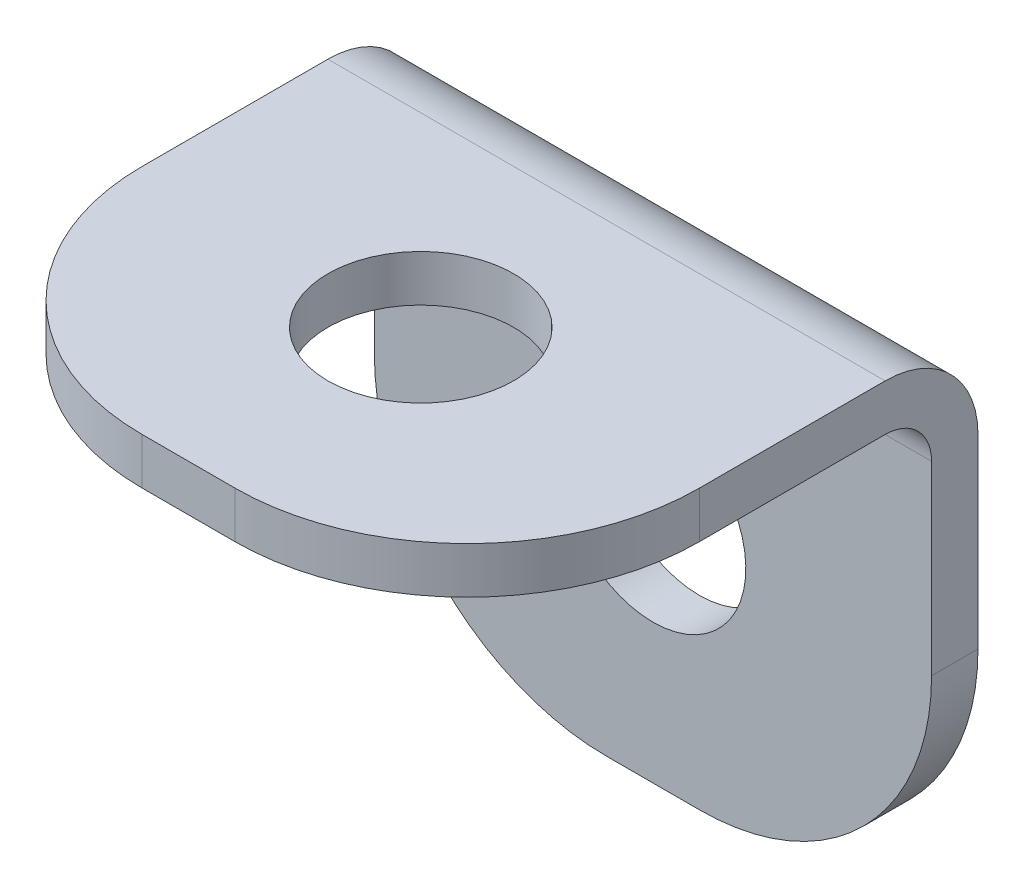
ISO-10303-21;
HEADER;
FILE_DESCRIPTION(('STEP AP214'),'2;1');
FILE_NAME('part.step','',(''),(''),'','','');
FILE_SCHEMA(('AUTOMOTIVE_DESIGN { 1 0 10303 214 1 1 1 1 }'));
ENDSEC;
DATA;
#1=APPLICATION_CONTEXT('core data for automotive mechanical design processes');
#2=APPLICATION_PROTOCOL_DEFINITION('international standard','automotive_design',2000,#1);
#3=PRODUCT_CONTEXT('',#1,'mechanical');
#4=PRODUCT('Part','Part','',(#3));
#5=PRODUCT_RELATED_PRODUCT_CATEGORY('part','',(#4));
#6=PRODUCT_DEFINITION_FORMATION('','',#4);
#7=PRODUCT_DEFINITION_CONTEXT('part definition',#1,'design');
#8=PRODUCT_DEFINITION('design','',#6,#7);
#9=PRODUCT_DEFINITION_SHAPE('','',#8);
#10=(LENGTH_UNIT() NAMED_UNIT(*) SI_UNIT(.MILLI.,.METRE.));
#11=(NAMED_UNIT(*) PLANE_ANGLE_UNIT() SI_UNIT($,.RADIAN.));
#12=(NAMED_UNIT(*) SI_UNIT($,.STERADIAN.) SOLID_ANGLE_UNIT());
#13=UNCERTAINTY_MEASURE_WITH_UNIT(LENGTH_MEASURE(1.E-05),#10,'distance_accuracy_value','');
#14=(GEOMETRIC_REPRESENTATION_CONTEXT(3) GLOBAL_UNCERTAINTY_ASSIGNED_CONTEXT((#13)) GLOBAL_UNIT_ASSIGNED_CONTEXT((#10,
#11,#12)) REPRESENTATION_CONTEXT('',''));
#15=CARTESIAN_POINT('',(0.,0.,0.));
#16=DIRECTION('',(0.,0.,1.));
#17=DIRECTION('',(1.,0.,0.));
#18=AXIS2_PLACEMENT_3D('',#15,#16,#17);
#19=CARTESIAN_POINT('',(1.,0.,5.));
#20=DIRECTION('',(0.,1.,0.));
#21=DIRECTION('',(0.,0.,1.));
#22=AXIS2_PLACEMENT_3D('',#19,#20,#21);
#23=PLANE('',#22);
#24=CARTESIAN_POINT('',(0.,0.,5.));
#25=DIRECTION('',(0.,1.,0.));
#26=DIRECTION('',(0.,0.,1.));
#27=AXIS2_PLACEMENT_3D('',#24,#25,#26);
#28=CIRCLE('',#27,2.);
#29=CARTESIAN_POINT('',(0.,0.,7.));
#30=VERTEX_POINT('',#29);
#31=EDGE_CURVE('E137',#30,#30,#28,.T.);
#32=ORIENTED_EDGE('',*,*,#31,.T.);
#33=EDGE_LOOP('',(#32));
#34=FACE_BOUND('',#33,.T.);
#35=DIRECTION('',(0.,0.,1.));
#36=VECTOR('',#35,1.);
#37=CARTESIAN_POINT('',(-6.,0.,5.));
#38=LINE('',#37,#36);
#39=CARTESIAN_POINT('',(-6.,0.,0.999999999999999));
#40=VERTEX_POINT('',#39);
#41=CARTESIAN_POINT('',(-6.,0.,5.));
#42=VERTEX_POINT('',#41);
#43=EDGE_CURVE('E172',#40,#42,#38,.T.);
#44=ORIENTED_EDGE('',*,*,#43,.F.);
#45=DIRECTION('',(-1.,0.,0.));
#46=VECTOR('',#45,1.);
#47=CARTESIAN_POINT('',(6.,0.,0.999999999999997));
#48=LINE('',#47,#46);
#49=CARTESIAN_POINT('',(6.,0.,0.999999999999997));
#50=VERTEX_POINT('',#49);
#51=EDGE_CURVE('E212',#40,#50,#48,.F.);
#52=ORIENTED_EDGE('',*,*,#51,.T.);
#53=DIRECTION('',(0.,0.,-1.));
#54=VECTOR('',#53,1.);
#55=CARTESIAN_POINT('',(6.,0.,4.99999999999999));
#56=LINE('',#55,#54);
#57=CARTESIAN_POINT('',(6.,0.,4.99999999999999));
#58=VERTEX_POINT('',#57);
#59=EDGE_CURVE('E179',#58,#50,#56,.T.);
#60=ORIENTED_EDGE('',*,*,#59,.F.);
#61=CARTESIAN_POINT('',(1.,0.,5.));
#62=DIRECTION('',(0.,1.,0.));
#63=DIRECTION('',(0.,0.,1.));
#64=AXIS2_PLACEMENT_3D('',#61,#62,#63);
#65=CIRCLE('',#64,5.);
#66=CARTESIAN_POINT('',(1.,0.,10.));
#67=VERTEX_POINT('',#66);
#68=EDGE_CURVE('E194',#67,#58,#65,.T.);
#69=ORIENTED_EDGE('',*,*,#68,.F.);
#70=DIRECTION('',(1.,0.,0.));
#71=VECTOR('',#70,1.);
#72=CARTESIAN_POINT('',(-1.,0.,10.));
#73=LINE('',#72,#71);
#74=CARTESIAN_POINT('',(-1.,0.,10.));
#75=VERTEX_POINT('',#74);
#76=EDGE_CURVE('E192',#75,#67,#73,.T.);
#77=ORIENTED_EDGE('',*,*,#76,.F.);
#78=CARTESIAN_POINT('',(-1.,0.,5.));
#79=DIRECTION('',(0.,1.,0.));
#80=DIRECTION('',(0.,0.,-1.));
#81=AXIS2_PLACEMENT_3D('',#78,#79,#80);
#82=CIRCLE('',#81,5.);
#83=EDGE_CURVE('E190',#42,#75,#82,.T.);
#84=ORIENTED_EDGE('',*,*,#83,.F.);
#85=EDGE_LOOP('',(#44,#52,#60,#69,#77,#84));
#86=FACE_BOUND('',#85,.T.);
#87=ADVANCED_FACE('F31',(#34,#86),#23,.F.);
#88=CARTESIAN_POINT('',(1.,1.,5.));
#89=DIRECTION('',(0.,1.,0.));
#90=DIRECTION('',(0.,0.,1.));
#91=AXIS2_PLACEMENT_3D('',#88,#89,#90);
#92=PLANE('',#91);
#93=DIRECTION('',(0.,0.,-1.));
#94=VECTOR('',#93,1.);
#95=CARTESIAN_POINT('',(6.,1.,-1.));
#96=LINE('',#95,#94);
#97=CARTESIAN_POINT('',(6.,1.,4.99999999999999));
#98=VERTEX_POINT('',#97);
#99=CARTESIAN_POINT('',(6.,1.,0.999999999999997));
#100=VERTEX_POINT('',#99);
#101=EDGE_CURVE('E175',#98,#100,#96,.T.);
#102=ORIENTED_EDGE('',*,*,#101,.T.);
#103=DIRECTION('',(-1.,0.,0.));
#104=VECTOR('',#103,1.);
#105=CARTESIAN_POINT('',(-6.,1.,1.));
#106=LINE('',#105,#104);
#107=CARTESIAN_POINT('',(-6.,1.,1.));
#108=VERTEX_POINT('',#107);
#109=EDGE_CURVE('E218',#100,#108,#106,.T.);
#110=ORIENTED_EDGE('',*,*,#109,.T.);
#111=DIRECTION('',(0.,0.,1.));
#112=VECTOR('',#111,1.);
#113=CARTESIAN_POINT('',(-6.,1.,0.));
#114=LINE('',#113,#112);
#115=CARTESIAN_POINT('',(-6.,1.,5.));
#116=VERTEX_POINT('',#115);
#117=EDGE_CURVE('E178',#108,#116,#114,.T.);
#118=ORIENTED_EDGE('',*,*,#117,.T.);
#119=CARTESIAN_POINT('',(-1.,1.,5.));
#120=DIRECTION('',(0.,1.,0.));
#121=DIRECTION('',(0.,0.,-1.));
#122=AXIS2_PLACEMENT_3D('',#119,#120,#121);
#123=CIRCLE('',#122,5.);
#124=CARTESIAN_POINT('',(-1.,1.,10.));
#125=VERTEX_POINT('',#124);
#126=EDGE_CURVE('E181',#116,#125,#123,.T.);
#127=ORIENTED_EDGE('',*,*,#126,.T.);
#128=DIRECTION('',(1.,0.,0.));
#129=VECTOR('',#128,1.);
#130=CARTESIAN_POINT('',(-1.,1.,10.));
#131=LINE('',#130,#129);
#132=CARTESIAN_POINT('',(1.,1.,10.));
#133=VERTEX_POINT('',#132);
#134=EDGE_CURVE('E183',#125,#133,#131,.T.);
#135=ORIENTED_EDGE('',*,*,#134,.T.);
#136=CARTESIAN_POINT('',(1.,1.,5.));
#137=DIRECTION('',(0.,1.,0.));
#138=DIRECTION('',(0.,0.,1.));
#139=AXIS2_PLACEMENT_3D('',#136,#137,#138);
#140=CIRCLE('',#139,5.);
#141=EDGE_CURVE('E185',#133,#98,#140,.T.);
#142=ORIENTED_EDGE('',*,*,#141,.T.);
#143=EDGE_LOOP('',(#102,#110,#118,#127,#135,#142));
#144=FACE_BOUND('',#143,.T.);
#145=CARTESIAN_POINT('',(0.,1.,5.));
#146=DIRECTION('',(0.,1.,0.));
#147=DIRECTION('',(0.,0.,1.));
#148=AXIS2_PLACEMENT_3D('',#145,#146,#147);
#149=CIRCLE('',#148,2.);
#150=CARTESIAN_POINT('',(0.,1.,7.));
#151=VERTEX_POINT('',#150);
#152=EDGE_CURVE('E169',#151,#151,#149,.T.);
#153=ORIENTED_EDGE('',*,*,#152,.F.);
#154=EDGE_LOOP('',(#153));
#155=FACE_BOUND('',#154,.T.);
#156=ADVANCED_FACE('F223',(#144,#155),#92,.T.);
#157=CARTESIAN_POINT('',(-6.,1.,-1.));
#158=DIRECTION('',(0.,0.,1.));
#159=DIRECTION('',(1.,0.,0.));
#160=AXIS2_PLACEMENT_3D('',#157,#158,#159);
#161=PLANE('',#160);
#162=DIRECTION('',(0.,-1.,0.));
#163=VECTOR('',#162,1.);
#164=CARTESIAN_POINT('',(-6.,1.,-1.));
#165=LINE('',#164,#163);
#166=CARTESIAN_POINT('',(-6.,-1.,-1.));
#167=VERTEX_POINT('',#166);
#168=CARTESIAN_POINT('',(-6.,-5.,-1.));
#169=VERTEX_POINT('',#168);
#170=EDGE_CURVE('E127',#167,#169,#165,.T.);
#171=ORIENTED_EDGE('',*,*,#170,.F.);
#172=DIRECTION('',(-1.,0.,0.));
#173=VECTOR('',#172,1.);
#174=CARTESIAN_POINT('',(6.,-1.,-1.));
#175=LINE('',#174,#173);
#176=CARTESIAN_POINT('',(6.,-1.,-1.));
#177=VERTEX_POINT('',#176);
#178=EDGE_CURVE('E39',#167,#177,#175,.F.);
#179=ORIENTED_EDGE('',*,*,#178,.T.);
#180=DIRECTION('',(0.,-1.,0.));
#181=VECTOR('',#180,1.);
#182=CARTESIAN_POINT('',(6.,1.,-1.));
#183=LINE('',#182,#181);
#184=CARTESIAN_POINT('',(6.,-4.99999999999999,-1.00000000000001));
#185=VERTEX_POINT('',#184);
#186=EDGE_CURVE('E116',#177,#185,#183,.T.);
#187=ORIENTED_EDGE('',*,*,#186,.T.);
#188=CARTESIAN_POINT('',(1.,-5.,-1.00000000000001));
#189=DIRECTION('',(0.,0.,1.));
#190=DIRECTION('',(0.,-1.,0.));
#191=AXIS2_PLACEMENT_3D('',#188,#189,#190);
#192=CIRCLE('',#191,5.);
#193=CARTESIAN_POINT('',(1.,-10.,-1.00000000000001));
#194=VERTEX_POINT('',#193);
#195=EDGE_CURVE('E122',#194,#185,#192,.T.);
#196=ORIENTED_EDGE('',*,*,#195,.F.);
#197=DIRECTION('',(1.,0.,0.));
#198=VECTOR('',#197,1.);
#199=CARTESIAN_POINT('',(-1.,-10.,-1.00000000000001));
#200=LINE('',#199,#198);
#201=CARTESIAN_POINT('',(-1.,-10.,-1.00000000000001));
#202=VERTEX_POINT('',#201);
#203=EDGE_CURVE('E141',#202,#194,#200,.T.);
#204=ORIENTED_EDGE('',*,*,#203,.F.);
#205=CARTESIAN_POINT('',(-1.,-5.,-1.00000000000001));
#206=DIRECTION('',(0.,0.,1.));
#207=DIRECTION('',(0.,1.,0.));
#208=AXIS2_PLACEMENT_3D('',#205,#206,#207);
#209=CIRCLE('',#208,5.);
#210=EDGE_CURVE('E144',#169,#202,#209,.T.);
#211=ORIENTED_EDGE('',*,*,#210,.F.);
#212=EDGE_LOOP('',(#171,#179,#187,#196,#204,#211));
#213=FACE_BOUND('',#212,.T.);
#214=CARTESIAN_POINT('',(0.,-5.,-1.00000000000001));
#215=DIRECTION('',(0.,0.,1.));
#216=DIRECTION('',(0.,-1.,0.));
#217=AXIS2_PLACEMENT_3D('',#214,#215,#216);
#218=CIRCLE('',#217,2.);
#219=CARTESIAN_POINT('',(0.,-7.,-1.00000000000001));
#220=VERTEX_POINT('',#219);
#221=EDGE_CURVE('E157',#220,#220,#218,.T.);
#222=ORIENTED_EDGE('',*,*,#221,.T.);
#223=EDGE_LOOP('',(#222));
#224=FACE_BOUND('',#223,.T.);
#225=ADVANCED_FACE('F118',(#213,#224),#161,.F.);
#226=CARTESIAN_POINT('',(-6.,1.,5.));
#227=DIRECTION('',(1.,0.,0.));
#228=DIRECTION('',(0.,0.,-1.));
#229=AXIS2_PLACEMENT_3D('',#226,#227,#228);
#230=PLANE('',#229);
#231=ORIENTED_EDGE('',*,*,#117,.F.);
#232=CARTESIAN_POINT('',(-6.,-1.,1.));
#233=DIRECTION('',(1.,0.,0.));
#234=DIRECTION('',(0.,0.,-1.));
#235=AXIS2_PLACEMENT_3D('',#232,#233,#234);
#236=CIRCLE('',#235,2.);
#237=EDGE_CURVE('E53',#108,#167,#236,.F.);
#238=ORIENTED_EDGE('',*,*,#237,.T.);
#239=ORIENTED_EDGE('',*,*,#170,.T.);
#240=DIRECTION('',(0.,0.,1.));
#241=VECTOR('',#240,1.);
#242=CARTESIAN_POINT('',(-6.,-5.,-1.));
#243=LINE('',#242,#241);
#244=CARTESIAN_POINT('',(-6.,-5.,0.));
#245=VERTEX_POINT('',#244);
#246=EDGE_CURVE('E154',#169,#245,#243,.T.);
#247=ORIENTED_EDGE('',*,*,#246,.T.);
#248=DIRECTION('',(0.,-1.,0.));
#249=VECTOR('',#248,1.);
#250=CARTESIAN_POINT('',(-6.,0.,0.));
#251=LINE('',#250,#249);
#252=CARTESIAN_POINT('',(-6.,-0.999999999999999,0.));
#253=VERTEX_POINT('',#252);
#254=EDGE_CURVE('E142',#253,#245,#251,.T.);
#255=ORIENTED_EDGE('',*,*,#254,.F.);
#256=CARTESIAN_POINT('',(-6.,-1.,0.999999999999999));
#257=DIRECTION('',(1.,0.,0.));
#258=DIRECTION('',(0.,0.,-1.));
#259=AXIS2_PLACEMENT_3D('',#256,#257,#258);
#260=CIRCLE('',#259,1.);
#261=EDGE_CURVE('E214',#253,#40,#260,.T.);
#262=ORIENTED_EDGE('',*,*,#261,.T.);
#263=ORIENTED_EDGE('',*,*,#43,.T.);
#264=DIRECTION('',(0.,-1.,0.));
#265=VECTOR('',#264,1.);
#266=CARTESIAN_POINT('',(-6.,1.,5.));
#267=LINE('',#266,#265);
#268=EDGE_CURVE('E206',#116,#42,#267,.T.);
#269=ORIENTED_EDGE('',*,*,#268,.F.);
#270=EDGE_LOOP('',(#231,#238,#239,#247,#255,#262,#263,#269));
#271=FACE_BOUND('',#270,.T.);
#272=ADVANCED_FACE('F227',(#271),#230,.F.);
#273=CARTESIAN_POINT('',(-1.,1.,5.));
#274=DIRECTION('',(0.,-1.,0.));
#275=DIRECTION('',(0.,0.,-1.));
#276=AXIS2_PLACEMENT_3D('',#273,#274,#275);
#277=CYLINDRICAL_SURFACE('',#276,5.);
#278=ORIENTED_EDGE('',*,*,#83,.T.);
#279=DIRECTION('',(0.,-1.,0.));
#280=VECTOR('',#279,1.);
#281=CARTESIAN_POINT('',(-1.,1.,10.));
#282=LINE('',#281,#280);
#283=EDGE_CURVE('E203',#125,#75,#282,.T.);
#284=ORIENTED_EDGE('',*,*,#283,.F.);
#285=ORIENTED_EDGE('',*,*,#126,.F.);
#286=ORIENTED_EDGE('',*,*,#268,.T.);
#287=EDGE_LOOP('',(#278,#284,#285,#286));
#288=FACE_BOUND('',#287,.T.);
#289=ADVANCED_FACE('F233',(#288),#277,.T.);
#290=CARTESIAN_POINT('',(-1.,1.,10.));
#291=DIRECTION('',(0.,0.,-1.));
#292=DIRECTION('',(-1.,0.,0.));
#293=AXIS2_PLACEMENT_3D('',#290,#291,#292);
#294=PLANE('',#293);
#295=ORIENTED_EDGE('',*,*,#76,.T.);
#296=DIRECTION('',(0.,-1.,0.));
#297=VECTOR('',#296,1.);
#298=CARTESIAN_POINT('',(1.,1.,10.));
#299=LINE('',#298,#297);
#300=EDGE_CURVE('E200',#133,#67,#299,.T.);
#301=ORIENTED_EDGE('',*,*,#300,.F.);
#302=ORIENTED_EDGE('',*,*,#134,.F.);
#303=ORIENTED_EDGE('',*,*,#283,.T.);
#304=EDGE_LOOP('',(#295,#301,#302,#303));
#305=FACE_BOUND('',#304,.T.);
#306=ADVANCED_FACE('F239',(#305),#294,.F.);
#307=CARTESIAN_POINT('',(1.,1.,5.));
#308=DIRECTION('',(0.,-1.,0.));
#309=DIRECTION('',(0.,0.,-1.));
#310=AXIS2_PLACEMENT_3D('',#307,#308,#309);
#311=CYLINDRICAL_SURFACE('',#310,5.);
#312=ORIENTED_EDGE('',*,*,#68,.T.);
#313=DIRECTION('',(0.,-1.,0.));
#314=VECTOR('',#313,1.);
#315=CARTESIAN_POINT('',(6.,1.,4.99999999999999));
#316=LINE('',#315,#314);
#317=EDGE_CURVE('E188',#98,#58,#316,.T.);
#318=ORIENTED_EDGE('',*,*,#317,.F.);
#319=ORIENTED_EDGE('',*,*,#141,.F.);
#320=ORIENTED_EDGE('',*,*,#300,.T.);
#321=EDGE_LOOP('',(#312,#318,#319,#320));
#322=FACE_BOUND('',#321,.T.);
#323=ADVANCED_FACE('F243',(#322),#311,.T.);
#324=CARTESIAN_POINT('',(6.,1.,4.99999999999999));
#325=DIRECTION('',(-1.,0.,0.));
#326=DIRECTION('',(0.,0.,1.));
#327=AXIS2_PLACEMENT_3D('',#324,#325,#326);
#328=PLANE('',#327);
#329=ORIENTED_EDGE('',*,*,#186,.F.);
#330=CARTESIAN_POINT('',(6.,-1.,0.999999999999997));
#331=DIRECTION('',(-1.,0.,0.));
#332=DIRECTION('',(0.,0.,1.));
#333=AXIS2_PLACEMENT_3D('',#330,#331,#332);
#334=CIRCLE('',#333,2.);
#335=EDGE_CURVE('E11',#177,#100,#334,.F.);
#336=ORIENTED_EDGE('',*,*,#335,.T.);
#337=ORIENTED_EDGE('',*,*,#101,.F.);
#338=ORIENTED_EDGE('',*,*,#317,.T.);
#339=ORIENTED_EDGE('',*,*,#59,.T.);
#340=CARTESIAN_POINT('',(6.,-1.,0.999999999999997));
#341=DIRECTION('',(-1.,0.,0.));
#342=DIRECTION('',(0.,0.,1.));
#343=AXIS2_PLACEMENT_3D('',#340,#341,#342);
#344=CIRCLE('',#343,1.);
#345=CARTESIAN_POINT('',(6.,-0.999999999999999,0.));
#346=VERTEX_POINT('',#345);
#347=EDGE_CURVE('E216',#50,#346,#344,.T.);
#348=ORIENTED_EDGE('',*,*,#347,.T.);
#349=DIRECTION('',(0.,1.,0.));
#350=VECTOR('',#349,1.);
#351=CARTESIAN_POINT('',(6.,-5.,0.));
#352=LINE('',#351,#350);
#353=CARTESIAN_POINT('',(6.,-5.,0.));
#354=VERTEX_POINT('',#353);
#355=EDGE_CURVE('E133',#354,#346,#352,.T.);
#356=ORIENTED_EDGE('',*,*,#355,.F.);
#357=DIRECTION('',(0.,0.,1.));
#358=VECTOR('',#357,1.);
#359=CARTESIAN_POINT('',(6.,-4.99999999999999,-1.00000000000001));
#360=LINE('',#359,#358);
#361=EDGE_CURVE('E130',#185,#354,#360,.T.);
#362=ORIENTED_EDGE('',*,*,#361,.F.);
#363=EDGE_LOOP('',(#329,#336,#337,#338,#339,#348,#356,#362));
#364=FACE_BOUND('',#363,.T.);
#365=ADVANCED_FACE('F131',(#364),#328,.F.);
#366=CARTESIAN_POINT('',(0.,1.,5.));
#367=DIRECTION('',(0.,-1.,0.));
#368=DIRECTION('',(0.,0.,-1.));
#369=AXIS2_PLACEMENT_3D('',#366,#367,#368);
#370=CYLINDRICAL_SURFACE('',#369,2.);
#371=ORIENTED_EDGE('',*,*,#152,.T.);
#372=EDGE_LOOP('',(#371));
#373=FACE_BOUND('',#372,.T.);
#374=ORIENTED_EDGE('',*,*,#31,.F.);
#375=EDGE_LOOP('',(#374));
#376=FACE_BOUND('',#375,.T.);
#377=ADVANCED_FACE('F278',(#373,#376),#370,.F.);
#378=CARTESIAN_POINT('',(1.,-5.,0.));
#379=DIRECTION('',(0.,0.,-1.));
#380=DIRECTION('',(0.,-1.,0.));
#381=AXIS2_PLACEMENT_3D('',#378,#379,#380);
#382=PLANE('',#381);
#383=CARTESIAN_POINT('',(0.,-5.,0.));
#384=DIRECTION('',(0.,0.,1.));
#385=DIRECTION('',(0.,-1.,0.));
#386=AXIS2_PLACEMENT_3D('',#383,#384,#385);
#387=CIRCLE('',#386,2.);
#388=CARTESIAN_POINT('',(0.,-7.,0.));
#389=VERTEX_POINT('',#388);
#390=EDGE_CURVE('E149',#389,#389,#387,.T.);
#391=ORIENTED_EDGE('',*,*,#390,.F.);
#392=EDGE_LOOP('',(#391));
#393=FACE_BOUND('',#392,.T.);
#394=ORIENTED_EDGE('',*,*,#355,.T.);
#395=DIRECTION('',(-1.,0.,0.));
#396=VECTOR('',#395,1.);
#397=CARTESIAN_POINT('',(-6.,-0.999999999999999,0.));
#398=LINE('',#397,#396);
#399=EDGE_CURVE('E126',#346,#253,#398,.T.);
#400=ORIENTED_EDGE('',*,*,#399,.T.);
#401=ORIENTED_EDGE('',*,*,#254,.T.);
#402=CARTESIAN_POINT('',(-1.,-5.,0.));
#403=DIRECTION('',(0.,0.,1.));
#404=DIRECTION('',(0.,1.,0.));
#405=AXIS2_PLACEMENT_3D('',#402,#403,#404);
#406=CIRCLE('',#405,5.);
#407=CARTESIAN_POINT('',(-1.,-10.,0.));
#408=VERTEX_POINT('',#407);
#409=EDGE_CURVE('E146',#245,#408,#406,.T.);
#410=ORIENTED_EDGE('',*,*,#409,.T.);
#411=DIRECTION('',(1.,0.,0.));
#412=VECTOR('',#411,1.);
#413=CARTESIAN_POINT('',(-1.,-10.,0.));
#414=LINE('',#413,#412);
#415=CARTESIAN_POINT('',(1.,-10.,0.));
#416=VERTEX_POINT('',#415);
#417=EDGE_CURVE('E159',#408,#416,#414,.T.);
#418=ORIENTED_EDGE('',*,*,#417,.T.);
#419=CARTESIAN_POINT('',(1.,-5.,0.));
#420=DIRECTION('',(0.,0.,1.));
#421=DIRECTION('',(0.,-1.,0.));
#422=AXIS2_PLACEMENT_3D('',#419,#420,#421);
#423=CIRCLE('',#422,5.);
#424=EDGE_CURVE('E156',#416,#354,#423,.T.);
#425=ORIENTED_EDGE('',*,*,#424,.T.);
#426=EDGE_LOOP('',(#394,#400,#401,#410,#418,#425));
#427=FACE_BOUND('',#426,.T.);
#428=ADVANCED_FACE('F252',(#393,#427),#382,.F.);
#429=CARTESIAN_POINT('',(1.,-5.,-1.00000000000001));
#430=DIRECTION('',(0.,0.,1.));
#431=DIRECTION('',(0.,-1.,0.));
#432=AXIS2_PLACEMENT_3D('',#429,#430,#431);
#433=CYLINDRICAL_SURFACE('',#432,5.);
#434=ORIENTED_EDGE('',*,*,#424,.F.);
#435=DIRECTION('',(0.,0.,1.));
#436=VECTOR('',#435,1.);
#437=CARTESIAN_POINT('',(1.,-10.,-1.00000000000001));
#438=LINE('',#437,#436);
#439=EDGE_CURVE('E138',#194,#416,#438,.T.);
#440=ORIENTED_EDGE('',*,*,#439,.F.);
#441=ORIENTED_EDGE('',*,*,#195,.T.);
#442=ORIENTED_EDGE('',*,*,#361,.T.);
#443=EDGE_LOOP('',(#434,#440,#441,#442));
#444=FACE_BOUND('',#443,.T.);
#445=ADVANCED_FACE('F140',(#444),#433,.T.);
#446=CARTESIAN_POINT('',(-1.,-10.,-1.00000000000001));
#447=DIRECTION('',(0.,-1.,0.));
#448=DIRECTION('',(0.,0.,-1.));
#449=AXIS2_PLACEMENT_3D('',#446,#447,#448);
#450=PLANE('',#449);
#451=ORIENTED_EDGE('',*,*,#417,.F.);
#452=DIRECTION('',(0.,0.,1.));
#453=VECTOR('',#452,1.);
#454=CARTESIAN_POINT('',(-1.,-10.,-1.00000000000001));
#455=LINE('',#454,#453);
#456=EDGE_CURVE('E166',#202,#408,#455,.T.);
#457=ORIENTED_EDGE('',*,*,#456,.F.);
#458=ORIENTED_EDGE('',*,*,#203,.T.);
#459=ORIENTED_EDGE('',*,*,#439,.T.);
#460=EDGE_LOOP('',(#451,#457,#458,#459));
#461=FACE_BOUND('',#460,.T.);
#462=ADVANCED_FACE('F257',(#461),#450,.T.);
#463=CARTESIAN_POINT('',(-1.,-5.,-1.00000000000001));
#464=DIRECTION('',(0.,0.,1.));
#465=DIRECTION('',(0.,-1.,0.));
#466=AXIS2_PLACEMENT_3D('',#463,#464,#465);
#467=CYLINDRICAL_SURFACE('',#466,5.);
#468=ORIENTED_EDGE('',*,*,#409,.F.);
#469=ORIENTED_EDGE('',*,*,#246,.F.);
#470=ORIENTED_EDGE('',*,*,#210,.T.);
#471=ORIENTED_EDGE('',*,*,#456,.T.);
#472=EDGE_LOOP('',(#468,#469,#470,#471));
#473=FACE_BOUND('',#472,.T.);
#474=ADVANCED_FACE('F261',(#473),#467,.T.);
#475=CARTESIAN_POINT('',(0.,-5.,-1.00000000000001));
#476=DIRECTION('',(0.,0.,1.));
#477=DIRECTION('',(0.,-1.,0.));
#478=AXIS2_PLACEMENT_3D('',#475,#476,#477);
#479=CYLINDRICAL_SURFACE('',#478,2.);
#480=ORIENTED_EDGE('',*,*,#221,.F.);
#481=EDGE_LOOP('',(#480));
#482=FACE_BOUND('',#481,.T.);
#483=ORIENTED_EDGE('',*,*,#390,.T.);
#484=EDGE_LOOP('',(#483));
#485=FACE_BOUND('',#484,.T.);
#486=ADVANCED_FACE('F266',(#482,#485),#479,.F.);
#487=CARTESIAN_POINT('',(1.,-1.,0.999999999999997));
#488=DIRECTION('',(1.,0.,0.));
#489=DIRECTION('',(0.,0.,-1.));
#490=AXIS2_PLACEMENT_3D('',#487,#488,#489);
#491=CYLINDRICAL_SURFACE('',#490,1.);
#492=ORIENTED_EDGE('',*,*,#347,.F.);
#493=ORIENTED_EDGE('',*,*,#51,.F.);
#494=ORIENTED_EDGE('',*,*,#261,.F.);
#495=ORIENTED_EDGE('',*,*,#399,.F.);
#496=EDGE_LOOP('',(#492,#493,#494,#495));
#497=FACE_BOUND('',#496,.T.);
#498=ADVANCED_FACE('F249',(#497),#491,.F.);
#499=CARTESIAN_POINT('',(1.,-1.,0.999999999999998));
#500=DIRECTION('',(1.,0.,0.));
#501=DIRECTION('',(0.,0.,-1.));
#502=AXIS2_PLACEMENT_3D('',#499,#500,#501);
#503=CYLINDRICAL_SURFACE('',#502,2.);
#504=ORIENTED_EDGE('',*,*,#335,.F.);
#505=ORIENTED_EDGE('',*,*,#178,.F.);
#506=ORIENTED_EDGE('',*,*,#237,.F.);
#507=ORIENTED_EDGE('',*,*,#109,.F.);
#508=EDGE_LOOP('',(#504,#505,#506,#507));
#509=FACE_BOUND('',#508,.T.);
#510=ADVANCED_FACE('F33',(#509),#503,.T.);
#511=CLOSED_SHELL('',(#87,#156,#225,#272,#289,#306,#323,#365,#377,#428,#445,#462,#474,#486,#498,#510));
#512=MANIFOLD_SOLID_BREP('B2',#511);
#513=ADVANCED_BREP_SHAPE_REPRESENTATION('',(#18,#512),#14);
#514=SHAPE_DEFINITION_REPRESENTATION(#9,#513);
ENDSEC;
END-ISO-10303-21;
